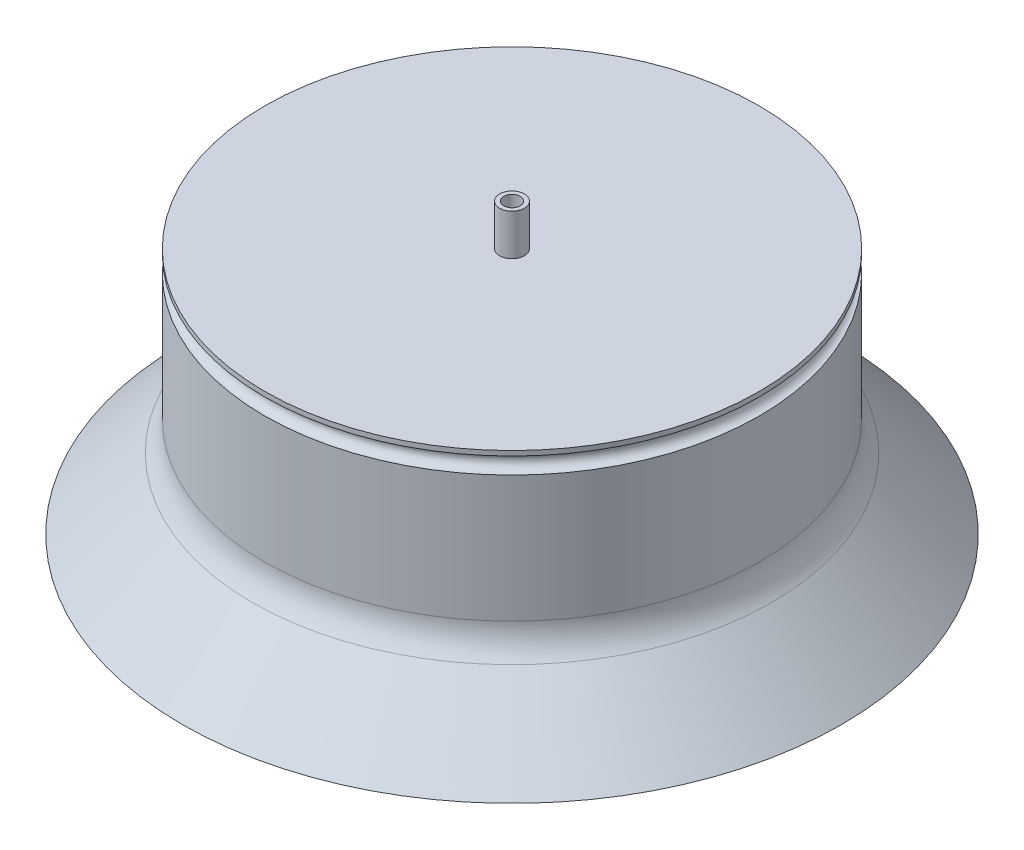
ISO-10303-21;
HEADER;
FILE_DESCRIPTION(('STEP AP214'),'2;1');
FILE_NAME('part.step','',(''),(''),'','','');
FILE_SCHEMA(('AUTOMOTIVE_DESIGN { 1 0 10303 214 1 1 1 1 }'));
ENDSEC;
DATA;
#1=APPLICATION_CONTEXT('core data for automotive mechanical design processes');
#2=APPLICATION_PROTOCOL_DEFINITION('international standard','automotive_design',2000,#1);
#3=PRODUCT_CONTEXT('',#1,'mechanical');
#4=PRODUCT('Part','Part','',(#3));
#5=PRODUCT_RELATED_PRODUCT_CATEGORY('part','',(#4));
#6=PRODUCT_DEFINITION_FORMATION('','',#4);
#7=PRODUCT_DEFINITION_CONTEXT('part definition',#1,'design');
#8=PRODUCT_DEFINITION('design','',#6,#7);
#9=PRODUCT_DEFINITION_SHAPE('','',#8);
#10=(LENGTH_UNIT() NAMED_UNIT(*) SI_UNIT(.MILLI.,.METRE.));
#11=(NAMED_UNIT(*) PLANE_ANGLE_UNIT() SI_UNIT($,.RADIAN.));
#12=(NAMED_UNIT(*) SI_UNIT($,.STERADIAN.) SOLID_ANGLE_UNIT());
#13=UNCERTAINTY_MEASURE_WITH_UNIT(LENGTH_MEASURE(1.E-05),#10,'distance_accuracy_value','');
#14=(GEOMETRIC_REPRESENTATION_CONTEXT(3) GLOBAL_UNCERTAINTY_ASSIGNED_CONTEXT((#13)) GLOBAL_UNIT_ASSIGNED_CONTEXT((#10,
#11,#12)) REPRESENTATION_CONTEXT('',''));
#15=CARTESIAN_POINT('',(0.,0.,0.));
#16=DIRECTION('',(0.,0.,1.));
#17=DIRECTION('',(1.,0.,0.));
#18=AXIS2_PLACEMENT_3D('',#15,#16,#17);
#19=CARTESIAN_POINT('',(0.,60.,0.));
#20=DIRECTION('',(0.,-1.,0.));
#21=DIRECTION('',(0.,0.,-1.));
#22=AXIS2_PLACEMENT_3D('',#19,#20,#21);
#23=CYLINDRICAL_SURFACE('',#22,60.);
#24=CARTESIAN_POINT('',(0.,58.8390307862441,0.));
#25=DIRECTION('',(0.,-1.,0.));
#26=DIRECTION('',(0.,0.,-1.));
#27=AXIS2_PLACEMENT_3D('',#24,#25,#26);
#28=CIRCLE('',#27,60.);
#29=CARTESIAN_POINT('',(0.,58.8390307862441,-60.));
#30=VERTEX_POINT('',#29);
#31=EDGE_CURVE('E52',#30,#30,#28,.F.);
#32=ORIENTED_EDGE('',*,*,#31,.T.);
#33=EDGE_LOOP('',(#32));
#34=FACE_BOUND('',#33,.T.);
#35=CARTESIAN_POINT('',(0.,60.,0.));
#36=DIRECTION('',(0.,1.,0.));
#37=DIRECTION('',(0.,0.,1.));
#38=AXIS2_PLACEMENT_3D('',#35,#36,#37);
#39=CIRCLE('',#38,60.);
#40=CARTESIAN_POINT('',(0.,60.,60.));
#41=VERTEX_POINT('',#40);
#42=EDGE_CURVE('E61',#41,#41,#39,.T.);
#43=ORIENTED_EDGE('',*,*,#42,.F.);
#44=EDGE_LOOP('',(#43));
#45=FACE_BOUND('',#44,.T.);
#46=ADVANCED_FACE('F34',(#34,#45),#23,.T.);
#47=CARTESIAN_POINT('',(0.,60.,0.));
#48=DIRECTION('',(0.,1.,0.));
#49=DIRECTION('',(0.,0.,1.));
#50=AXIS2_PLACEMENT_3D('',#47,#48,#49);
#51=PLANE('',#50);
#52=CARTESIAN_POINT('',(0.,60.,0.));
#53=DIRECTION('',(0.,1.,0.));
#54=DIRECTION('',(0.,0.,1.));
#55=AXIS2_PLACEMENT_3D('',#52,#53,#54);
#56=CIRCLE('',#55,3.);
#57=CARTESIAN_POINT('',(0.,60.,3.));
#58=VERTEX_POINT('',#57);
#59=EDGE_CURVE('E65',#58,#58,#56,.T.);
#60=ORIENTED_EDGE('',*,*,#59,.F.);
#61=EDGE_LOOP('',(#60));
#62=FACE_BOUND('',#61,.T.);
#63=ORIENTED_EDGE('',*,*,#42,.T.);
#64=EDGE_LOOP('',(#63));
#65=FACE_BOUND('',#64,.T.);
#66=ADVANCED_FACE('F93',(#62,#65),#51,.T.);
#67=CARTESIAN_POINT('',(0.,70.,0.));
#68=DIRECTION('',(0.,-1.,0.));
#69=DIRECTION('',(0.,0.,-1.));
#70=AXIS2_PLACEMENT_3D('',#67,#68,#69);
#71=CYLINDRICAL_SURFACE('',#70,3.);
#72=CARTESIAN_POINT('',(0.,70.,0.));
#73=DIRECTION('',(0.,1.,0.));
#74=DIRECTION('',(0.,0.,1.));
#75=AXIS2_PLACEMENT_3D('',#72,#73,#74);
#76=CIRCLE('',#75,3.);
#77=CARTESIAN_POINT('',(0.,70.,3.));
#78=VERTEX_POINT('',#77);
#79=EDGE_CURVE('E64',#78,#78,#76,.T.);
#80=ORIENTED_EDGE('',*,*,#79,.F.);
#81=EDGE_LOOP('',(#80));
#82=FACE_BOUND('',#81,.T.);
#83=ORIENTED_EDGE('',*,*,#59,.T.);
#84=EDGE_LOOP('',(#83));
#85=FACE_BOUND('',#84,.T.);
#86=ADVANCED_FACE('F87',(#82,#85),#71,.T.);
#87=CARTESIAN_POINT('',(0.,70.,0.));
#88=DIRECTION('',(0.,1.,0.));
#89=DIRECTION('',(0.,0.,1.));
#90=AXIS2_PLACEMENT_3D('',#87,#88,#89);
#91=PLANE('',#90);
#92=CARTESIAN_POINT('',(0.,70.,0.));
#93=DIRECTION('',(0.,1.,0.));
#94=DIRECTION('',(0.,0.,1.));
#95=AXIS2_PLACEMENT_3D('',#92,#93,#94);
#96=CIRCLE('',#95,2.);
#97=CARTESIAN_POINT('',(0.,70.,2.));
#98=VERTEX_POINT('',#97);
#99=EDGE_CURVE('E55',#98,#98,#96,.T.);
#100=ORIENTED_EDGE('',*,*,#99,.F.);
#101=EDGE_LOOP('',(#100));
#102=FACE_BOUND('',#101,.T.);
#103=ORIENTED_EDGE('',*,*,#79,.T.);
#104=EDGE_LOOP('',(#103));
#105=FACE_BOUND('',#104,.T.);
#106=ADVANCED_FACE('F81',(#102,#105),#91,.T.);
#107=CARTESIAN_POINT('',(0.,50.,0.));
#108=DIRECTION('',(0.,1.,0.));
#109=DIRECTION('',(0.,0.,1.));
#110=AXIS2_PLACEMENT_3D('',#107,#108,#109);
#111=CYLINDRICAL_SURFACE('',#110,2.);
#112=CARTESIAN_POINT('',(0.,50.,0.));
#113=DIRECTION('',(0.,1.,0.));
#114=DIRECTION('',(0.,0.,1.));
#115=AXIS2_PLACEMENT_3D('',#112,#113,#114);
#116=CIRCLE('',#115,2.);
#117=CARTESIAN_POINT('',(0.,50.,2.));
#118=VERTEX_POINT('',#117);
#119=EDGE_CURVE('E68',#118,#118,#116,.T.);
#120=ORIENTED_EDGE('',*,*,#119,.F.);
#121=EDGE_LOOP('',(#120));
#122=FACE_BOUND('',#121,.T.);
#123=ORIENTED_EDGE('',*,*,#99,.T.);
#124=EDGE_LOOP('',(#123));
#125=FACE_BOUND('',#124,.T.);
#126=ADVANCED_FACE('F78',(#122,#125),#111,.F.);
#127=CARTESIAN_POINT('',(0.,50.,0.));
#128=DIRECTION('',(0.,1.,0.));
#129=DIRECTION('',(0.,0.,1.));
#130=AXIS2_PLACEMENT_3D('',#127,#128,#129);
#131=PLANE('',#130);
#132=ORIENTED_EDGE('',*,*,#119,.T.);
#133=EDGE_LOOP('',(#132));
#134=FACE_BOUND('',#133,.T.);
#135=ADVANCED_FACE('F76',(#134),#131,.T.);
#136=CARTESIAN_POINT('',(0.,56.8390307862441,0.));
#137=DIRECTION('',(0.,1.,0.));
#138=DIRECTION('',(0.,0.,1.));
#139=AXIS2_PLACEMENT_3D('',#136,#137,#138);
#140=TOROIDAL_SURFACE('',#139,60.,2.);
#141=CARTESIAN_POINT('',(0.,54.8390307862441,0.));
#142=DIRECTION('',(0.,1.,0.));
#143=DIRECTION('',(0.,0.,1.));
#144=AXIS2_PLACEMENT_3D('',#141,#142,#143);
#145=CIRCLE('',#144,60.);
#146=CARTESIAN_POINT('',(0.,54.8390307862441,60.));
#147=VERTEX_POINT('',#146);
#148=EDGE_CURVE('E56',#147,#147,#145,.F.);
#149=ORIENTED_EDGE('',*,*,#148,.F.);
#150=EDGE_LOOP('',(#149));
#151=FACE_BOUND('',#150,.T.);
#152=ORIENTED_EDGE('',*,*,#31,.F.);
#153=EDGE_LOOP('',(#152));
#154=FACE_BOUND('',#153,.T.);
#155=ADVANCED_FACE('F120',(#151,#154),#140,.F.);
#156=CARTESIAN_POINT('',(0.,-0.0001,0.));
#157=DIRECTION('',(0.,1.,0.));
#158=DIRECTION('',(0.,0.,1.));
#159=AXIS2_PLACEMENT_3D('',#156,#157,#158);
#160=PLANE('',#159);
#161=CARTESIAN_POINT('',(0.,-0.0001,0.));
#162=DIRECTION('',(0.,1.,0.));
#163=DIRECTION('',(0.,0.,1.));
#164=AXIS2_PLACEMENT_3D('',#161,#162,#163);
#165=CIRCLE('',#164,80.);
#166=CARTESIAN_POINT('',(0.,-0.0001,80.));
#167=VERTEX_POINT('',#166);
#168=EDGE_CURVE('E49',#167,#167,#165,.T.);
#169=ORIENTED_EDGE('',*,*,#168,.F.);
#170=EDGE_LOOP('',(#169));
#171=FACE_BOUND('',#170,.T.);
#172=ADVANCED_FACE('F123',(#171),#160,.F.);
#173=CARTESIAN_POINT('',(0.,-0.0001,0.));
#174=DIRECTION('',(0.,1.,0.));
#175=DIRECTION('',(0.,0.,1.));
#176=AXIS2_PLACEMENT_3D('',#173,#174,#175);
#177=CYLINDRICAL_SURFACE('',#176,80.);
#178=CARTESIAN_POINT('',(0.,-1.14491749414469E-13,0.));
#179=DIRECTION('',(0.,1.,0.));
#180=DIRECTION('',(0.,0.,1.));
#181=AXIS2_PLACEMENT_3D('',#178,#179,#180);
#182=CIRCLE('',#181,80.);
#183=CARTESIAN_POINT('',(0.,-1.14491749414469E-13,80.));
#184=VERTEX_POINT('',#183);
#185=EDGE_CURVE('E45',#184,#184,#182,.F.);
#186=ORIENTED_EDGE('',*,*,#185,.T.);
#187=EDGE_LOOP('',(#186));
#188=FACE_BOUND('',#187,.T.);
#189=ORIENTED_EDGE('',*,*,#168,.T.);
#190=EDGE_LOOP('',(#189));
#191=FACE_BOUND('',#190,.T.);
#192=ADVANCED_FACE('F116',(#188,#191),#177,.T.);
#193=CARTESIAN_POINT('',(0.,20.,0.));
#194=DIRECTION('',(0.,-1.,0.));
#195=DIRECTION('',(0.,0.,-1.));
#196=AXIS2_PLACEMENT_3D('',#193,#194,#195);
#197=CONICAL_SURFACE('',#196,59.9999999999999,0.785398163397447);
#198=CARTESIAN_POINT('',(0.,17.0710678118654,0.));
#199=DIRECTION('',(0.,1.,0.));
#200=DIRECTION('',(0.,0.,1.));
#201=AXIS2_PLACEMENT_3D('',#198,#199,#200);
#202=CIRCLE('',#201,62.9289321881345);
#203=CARTESIAN_POINT('',(0.,17.0710678118654,62.9289321881345));
#204=VERTEX_POINT('',#203);
#205=EDGE_CURVE('E10',#204,#204,#202,.F.);
#206=ORIENTED_EDGE('',*,*,#205,.T.);
#207=EDGE_LOOP('',(#206));
#208=FACE_BOUND('',#207,.T.);
#209=ORIENTED_EDGE('',*,*,#185,.F.);
#210=EDGE_LOOP('',(#209));
#211=FACE_BOUND('',#210,.T.);
#212=ADVANCED_FACE('F110',(#208,#211),#197,.T.);
#213=CARTESIAN_POINT('',(0.,24.1421356237309,0.));
#214=DIRECTION('',(0.,1.,0.));
#215=DIRECTION('',(0.,0.,1.));
#216=AXIS2_PLACEMENT_3D('',#213,#214,#215);
#217=CIRCLE('',#216,60.);
#218=CARTESIAN_POINT('',(0.,24.1421356237309,60.));
#219=VERTEX_POINT('',#218);
#220=EDGE_CURVE('E41',#219,#219,#217,.T.);
#221=ORIENTED_EDGE('',*,*,#220,.T.);
#222=EDGE_LOOP('',(#221));
#223=FACE_BOUND('',#222,.T.);
#224=ORIENTED_EDGE('',*,*,#148,.T.);
#225=EDGE_LOOP('',(#224));
#226=FACE_BOUND('',#225,.T.);
#227=ADVANCED_FACE('F105',(#223,#226),#23,.T.);
#228=CARTESIAN_POINT('',(0.,24.1421356237309,0.));
#229=DIRECTION('',(0.,1.,0.));
#230=DIRECTION('',(0.,0.,1.));
#231=AXIS2_PLACEMENT_3D('',#228,#229,#230);
#232=TOROIDAL_SURFACE('',#231,70.,10.);
#233=ORIENTED_EDGE('',*,*,#205,.F.);
#234=EDGE_LOOP('',(#233));
#235=FACE_BOUND('',#234,.T.);
#236=ORIENTED_EDGE('',*,*,#220,.F.);
#237=EDGE_LOOP('',(#236));
#238=FACE_BOUND('',#237,.T.);
#239=ADVANCED_FACE('F36',(#235,#238),#232,.F.);
#240=CLOSED_SHELL('',(#46,#66,#86,#106,#126,#135,#155,#172,#192,#212,#227,#239));
#241=MANIFOLD_SOLID_BREP('B2',#240);
#242=ADVANCED_BREP_SHAPE_REPRESENTATION('',(#18,#241),#14);
#243=SHAPE_DEFINITION_REPRESENTATION(#9,#242);
ENDSEC;
END-ISO-10303-21;
